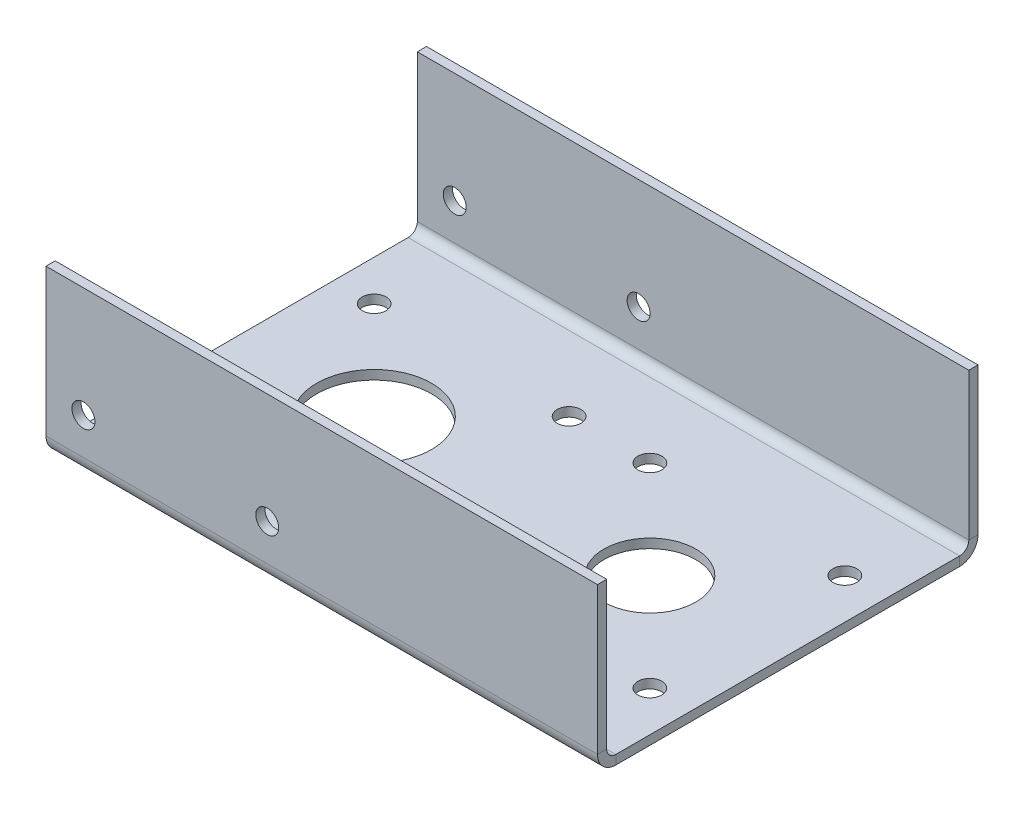
ISO-10303-21;
HEADER;
FILE_DESCRIPTION(('STEP AP214'),'2;1');
FILE_NAME('part.step','',(''),(''),'','','');
FILE_SCHEMA(('AUTOMOTIVE_DESIGN { 1 0 10303 214 1 1 1 1 }'));
ENDSEC;
DATA;
#1=APPLICATION_CONTEXT('core data for automotive mechanical design processes');
#2=APPLICATION_PROTOCOL_DEFINITION('international standard','automotive_design',2000,#1);
#3=PRODUCT_CONTEXT('',#1,'mechanical');
#4=PRODUCT('Part','Part','',(#3));
#5=PRODUCT_RELATED_PRODUCT_CATEGORY('part','',(#4));
#6=PRODUCT_DEFINITION_FORMATION('','',#4);
#7=PRODUCT_DEFINITION_CONTEXT('part definition',#1,'design');
#8=PRODUCT_DEFINITION('design','',#6,#7);
#9=PRODUCT_DEFINITION_SHAPE('','',#8);
#10=(LENGTH_UNIT() NAMED_UNIT(*) SI_UNIT(.MILLI.,.METRE.));
#11=(NAMED_UNIT(*) PLANE_ANGLE_UNIT() SI_UNIT($,.RADIAN.));
#12=(NAMED_UNIT(*) SI_UNIT($,.STERADIAN.) SOLID_ANGLE_UNIT());
#13=UNCERTAINTY_MEASURE_WITH_UNIT(LENGTH_MEASURE(1.E-05),#10,'distance_accuracy_value','');
#14=(GEOMETRIC_REPRESENTATION_CONTEXT(3) GLOBAL_UNCERTAINTY_ASSIGNED_CONTEXT((#13)) GLOBAL_UNIT_ASSIGNED_CONTEXT((#10,
#11,#12)) REPRESENTATION_CONTEXT('',''));
#15=CARTESIAN_POINT('',(0.,0.,0.));
#16=DIRECTION('',(0.,0.,1.));
#17=DIRECTION('',(1.,0.,0.));
#18=AXIS2_PLACEMENT_3D('',#15,#16,#17);
#19=CARTESIAN_POINT('',(0.,-1.27,0.));
#20=DIRECTION('',(0.,1.,0.));
#21=DIRECTION('',(0.,0.,1.));
#22=AXIS2_PLACEMENT_3D('',#19,#20,#21);
#23=PLANE('',#22);
#24=CARTESIAN_POINT('',(5.57961581839621,-1.27,13.4703841816037));
#25=DIRECTION('',(0.,1.,0.));
#26=DIRECTION('',(0.,0.,1.));
#27=AXIS2_PLACEMENT_3D('',#24,#25,#26);
#28=CIRCLE('',#27,1.651);
#29=CARTESIAN_POINT('',(5.57961581839621,-1.27,15.1213841816037));
#30=VERTEX_POINT('',#29);
#31=EDGE_CURVE('E297',#30,#30,#28,.T.);
#32=ORIENTED_EDGE('',*,*,#31,.T.);
#33=EDGE_LOOP('',(#32));
#34=FACE_BOUND('',#33,.T.);
#35=CARTESIAN_POINT('',(32.5203841816037,-1.27,-13.4703841816038));
#36=DIRECTION('',(0.,1.,0.));
#37=DIRECTION('',(0.,0.,1.));
#38=AXIS2_PLACEMENT_3D('',#35,#36,#37);
#39=CIRCLE('',#38,1.651);
#40=CARTESIAN_POINT('',(32.5203841816037,-1.27,-11.8193841816038));
#41=VERTEX_POINT('',#40);
#42=EDGE_CURVE('E294',#41,#41,#39,.T.);
#43=ORIENTED_EDGE('',*,*,#42,.T.);
#44=EDGE_LOOP('',(#43));
#45=FACE_BOUND('',#44,.T.);
#46=CARTESIAN_POINT('',(32.5203841816038,-1.27,13.4703841816037));
#47=DIRECTION('',(0.,1.,0.));
#48=DIRECTION('',(0.,0.,1.));
#49=AXIS2_PLACEMENT_3D('',#46,#47,#48);
#50=CIRCLE('',#49,1.651);
#51=CARTESIAN_POINT('',(32.5203841816038,-1.27,15.1213841816037));
#52=VERTEX_POINT('',#51);
#53=EDGE_CURVE('E289',#52,#52,#50,.T.);
#54=ORIENTED_EDGE('',*,*,#53,.T.);
#55=EDGE_LOOP('',(#54));
#56=FACE_BOUND('',#55,.T.);
#57=CARTESIAN_POINT('',(19.05,-1.27,0.));
#58=DIRECTION('',(0.,1.,0.));
#59=DIRECTION('',(0.,0.,1.));
#60=AXIS2_PLACEMENT_3D('',#57,#58,#59);
#61=CIRCLE('',#60,6.35);
#62=CARTESIAN_POINT('',(19.05,-1.27,6.35));
#63=VERTEX_POINT('',#62);
#64=EDGE_CURVE('E309',#63,#63,#61,.T.);
#65=ORIENTED_EDGE('',*,*,#64,.T.);
#66=EDGE_LOOP('',(#65));
#67=FACE_BOUND('',#66,.T.);
#68=CARTESIAN_POINT('',(5.5796158183962,-1.27,-13.4703841816037));
#69=DIRECTION('',(0.,1.,0.));
#70=DIRECTION('',(0.,0.,1.));
#71=AXIS2_PLACEMENT_3D('',#68,#69,#70);
#72=CIRCLE('',#71,1.651);
#73=CARTESIAN_POINT('',(5.5796158183962,-1.27,-11.8193841816037));
#74=VERTEX_POINT('',#73);
#75=EDGE_CURVE('E304',#74,#74,#72,.T.);
#76=ORIENTED_EDGE('',*,*,#75,.T.);
#77=EDGE_LOOP('',(#76));
#78=FACE_BOUND('',#77,.T.);
#79=CARTESIAN_POINT('',(-32.5203841816037,-1.27000000000001,13.4703841816038));
#80=DIRECTION('',(0.,1.,0.));
#81=DIRECTION('',(1.,0.,0.));
#82=AXIS2_PLACEMENT_3D('',#79,#80,#81);
#83=CIRCLE('',#82,1.65099999999999);
#84=CARTESIAN_POINT('',(-30.8693841816037,-1.27000000000001,13.4703841816038));
#85=VERTEX_POINT('',#84);
#86=EDGE_CURVE('E313',#85,#85,#83,.T.);
#87=ORIENTED_EDGE('',*,*,#86,.T.);
#88=EDGE_LOOP('',(#87));
#89=FACE_BOUND('',#88,.T.);
#90=CARTESIAN_POINT('',(-5.57961581839629,-1.27000000000001,13.4703841816038));
#91=DIRECTION('',(0.,1.,0.));
#92=DIRECTION('',(0.,0.,-1.));
#93=AXIS2_PLACEMENT_3D('',#90,#91,#92);
#94=CIRCLE('',#93,1.65099999999999);
#95=CARTESIAN_POINT('',(-5.57961581839629,-1.27000000000001,11.8193841816038));
#96=VERTEX_POINT('',#95);
#97=EDGE_CURVE('E320',#96,#96,#94,.T.);
#98=ORIENTED_EDGE('',*,*,#97,.T.);
#99=EDGE_LOOP('',(#98));
#100=FACE_BOUND('',#99,.T.);
#101=CARTESIAN_POINT('',(-5.57961581839639,-1.27000000000001,-13.4703841816038));
#102=DIRECTION('',(0.,1.,0.));
#103=DIRECTION('',(-1.,0.,0.));
#104=AXIS2_PLACEMENT_3D('',#101,#102,#103);
#105=CIRCLE('',#104,1.65099999999999);
#106=CARTESIAN_POINT('',(-7.23061581839638,-1.27000000000001,-13.4703841816038));
#107=VERTEX_POINT('',#106);
#108=EDGE_CURVE('E326',#107,#107,#105,.T.);
#109=ORIENTED_EDGE('',*,*,#108,.T.);
#110=EDGE_LOOP('',(#109));
#111=FACE_BOUND('',#110,.T.);
#112=CARTESIAN_POINT('',(-32.5203841816037,-1.27000000000001,-13.4703841816037));
#113=DIRECTION('',(0.,1.,0.));
#114=DIRECTION('',(0.,0.,1.));
#115=AXIS2_PLACEMENT_3D('',#112,#113,#114);
#116=CIRCLE('',#115,1.65099999999999);
#117=CARTESIAN_POINT('',(-32.5203841816037,-1.27000000000001,-11.8193841816038));
#118=VERTEX_POINT('',#117);
#119=EDGE_CURVE('E331',#118,#118,#116,.T.);
#120=ORIENTED_EDGE('',*,*,#119,.T.);
#121=EDGE_LOOP('',(#120));
#122=FACE_BOUND('',#121,.T.);
#123=CARTESIAN_POINT('',(-19.05,-1.27,0.));
#124=DIRECTION('',(0.,1.,0.));
#125=DIRECTION('',(0.,0.,1.));
#126=AXIS2_PLACEMENT_3D('',#123,#124,#125);
#127=CIRCLE('',#126,7.9375);
#128=CARTESIAN_POINT('',(-19.05,-1.27,7.93750000000001));
#129=VERTEX_POINT('',#128);
#130=EDGE_CURVE('E247',#129,#129,#127,.T.);
#131=ORIENTED_EDGE('',*,*,#130,.T.);
#132=EDGE_LOOP('',(#131));
#133=FACE_BOUND('',#132,.T.);
#134=DIRECTION('',(-1.,0.,0.));
#135=VECTOR('',#134,1.);
#136=CARTESIAN_POINT('',(-38.1,-1.27000000000001,-23.749));
#137=LINE('',#136,#135);
#138=CARTESIAN_POINT('',(-38.1,-1.27000000000001,-23.749));
#139=VERTEX_POINT('',#138);
#140=CARTESIAN_POINT('',(38.1,-1.27,-23.749));
#141=VERTEX_POINT('',#140);
#142=EDGE_CURVE('E136',#139,#141,#137,.F.);
#143=ORIENTED_EDGE('',*,*,#142,.T.);
#144=DIRECTION('',(0.,0.,-1.));
#145=VECTOR('',#144,1.);
#146=CARTESIAN_POINT('',(38.1,-1.27,-25.019));
#147=LINE('',#146,#145);
#148=CARTESIAN_POINT('',(38.1,-1.27,23.749));
#149=VERTEX_POINT('',#148);
#150=EDGE_CURVE('E47',#149,#141,#147,.T.);
#151=ORIENTED_EDGE('',*,*,#150,.F.);
#152=DIRECTION('',(1.,0.,0.));
#153=VECTOR('',#152,1.);
#154=CARTESIAN_POINT('',(38.1,-1.27,23.749));
#155=LINE('',#154,#153);
#156=CARTESIAN_POINT('',(-38.1,-1.27,23.749));
#157=VERTEX_POINT('',#156);
#158=EDGE_CURVE('E226',#149,#157,#155,.F.);
#159=ORIENTED_EDGE('',*,*,#158,.T.);
#160=DIRECTION('',(0.,0.,1.));
#161=VECTOR('',#160,1.);
#162=CARTESIAN_POINT('',(-38.1,-1.27,-25.019));
#163=LINE('',#162,#161);
#164=EDGE_CURVE('E11',#139,#157,#163,.T.);
#165=ORIENTED_EDGE('',*,*,#164,.F.);
#166=EDGE_LOOP('',(#143,#151,#159,#165));
#167=FACE_BOUND('',#166,.T.);
#168=ADVANCED_FACE('F38',(#34,#45,#56,#67,#78,#89,#100,#111,#122,#133,#167),#23,.F.);
#169=CARTESIAN_POINT('',(0.,0.,0.));
#170=DIRECTION('',(0.,1.,0.));
#171=DIRECTION('',(0.,0.,1.));
#172=AXIS2_PLACEMENT_3D('',#169,#170,#171);
#173=PLANE('',#172);
#174=CARTESIAN_POINT('',(5.57961581839621,0.,13.4703841816037));
#175=DIRECTION('',(0.,1.,0.));
#176=DIRECTION('',(1.,0.,0.));
#177=AXIS2_PLACEMENT_3D('',#174,#175,#176);
#178=CIRCLE('',#177,1.651);
#179=CARTESIAN_POINT('',(7.23061581839621,0.,13.4703841816037));
#180=VERTEX_POINT('',#179);
#181=EDGE_CURVE('E282',#180,#180,#178,.T.);
#182=ORIENTED_EDGE('',*,*,#181,.F.);
#183=EDGE_LOOP('',(#182));
#184=FACE_BOUND('',#183,.T.);
#185=CARTESIAN_POINT('',(32.5203841816037,0.,-13.4703841816038));
#186=DIRECTION('',(0.,1.,0.));
#187=DIRECTION('',(-1.,0.,0.));
#188=AXIS2_PLACEMENT_3D('',#185,#186,#187);
#189=CIRCLE('',#188,1.651);
#190=CARTESIAN_POINT('',(30.8693841816037,0.,-13.4703841816038));
#191=VERTEX_POINT('',#190);
#192=EDGE_CURVE('E286',#191,#191,#189,.T.);
#193=ORIENTED_EDGE('',*,*,#192,.F.);
#194=EDGE_LOOP('',(#193));
#195=FACE_BOUND('',#194,.T.);
#196=CARTESIAN_POINT('',(32.5203841816038,0.,13.4703841816037));
#197=DIRECTION('',(0.,1.,0.));
#198=DIRECTION('',(0.,0.,-1.));
#199=AXIS2_PLACEMENT_3D('',#196,#197,#198);
#200=CIRCLE('',#199,1.651);
#201=CARTESIAN_POINT('',(32.5203841816038,0.,11.8193841816037));
#202=VERTEX_POINT('',#201);
#203=EDGE_CURVE('E283',#202,#202,#200,.T.);
#204=ORIENTED_EDGE('',*,*,#203,.F.);
#205=EDGE_LOOP('',(#204));
#206=FACE_BOUND('',#205,.T.);
#207=CARTESIAN_POINT('',(19.05,0.,0.));
#208=DIRECTION('',(0.,1.,0.));
#209=DIRECTION('',(0.,0.,1.));
#210=AXIS2_PLACEMENT_3D('',#207,#208,#209);
#211=CIRCLE('',#210,6.35);
#212=CARTESIAN_POINT('',(19.05,0.,6.35));
#213=VERTEX_POINT('',#212);
#214=EDGE_CURVE('E301',#213,#213,#211,.T.);
#215=ORIENTED_EDGE('',*,*,#214,.F.);
#216=EDGE_LOOP('',(#215));
#217=FACE_BOUND('',#216,.T.);
#218=CARTESIAN_POINT('',(5.5796158183962,0.,-13.4703841816037));
#219=DIRECTION('',(0.,1.,0.));
#220=DIRECTION('',(0.,0.,1.));
#221=AXIS2_PLACEMENT_3D('',#218,#219,#220);
#222=CIRCLE('',#221,1.651);
#223=CARTESIAN_POINT('',(5.5796158183962,0.,-11.8193841816037));
#224=VERTEX_POINT('',#223);
#225=EDGE_CURVE('E300',#224,#224,#222,.T.);
#226=ORIENTED_EDGE('',*,*,#225,.F.);
#227=EDGE_LOOP('',(#226));
#228=FACE_BOUND('',#227,.T.);
#229=CARTESIAN_POINT('',(-32.5203841816037,0.,13.4703841816038));
#230=DIRECTION('',(0.,1.,0.));
#231=DIRECTION('',(1.,0.,0.));
#232=AXIS2_PLACEMENT_3D('',#229,#230,#231);
#233=CIRCLE('',#232,1.65099999999999);
#234=CARTESIAN_POINT('',(-30.8693841816037,0.,13.4703841816038));
#235=VERTEX_POINT('',#234);
#236=EDGE_CURVE('E317',#235,#235,#233,.T.);
#237=ORIENTED_EDGE('',*,*,#236,.F.);
#238=EDGE_LOOP('',(#237));
#239=FACE_BOUND('',#238,.T.);
#240=CARTESIAN_POINT('',(-5.57961581839629,0.,13.4703841816038));
#241=DIRECTION('',(0.,1.,0.));
#242=DIRECTION('',(0.,0.,-1.));
#243=AXIS2_PLACEMENT_3D('',#240,#241,#242);
#244=CIRCLE('',#243,1.65099999999999);
#245=CARTESIAN_POINT('',(-5.57961581839629,0.,11.8193841816038));
#246=VERTEX_POINT('',#245);
#247=EDGE_CURVE('E323',#246,#246,#244,.T.);
#248=ORIENTED_EDGE('',*,*,#247,.F.);
#249=EDGE_LOOP('',(#248));
#250=FACE_BOUND('',#249,.T.);
#251=CARTESIAN_POINT('',(-5.57961581839639,0.,-13.4703841816038));
#252=DIRECTION('',(0.,1.,0.));
#253=DIRECTION('',(-1.,0.,0.));
#254=AXIS2_PLACEMENT_3D('',#251,#252,#253);
#255=CIRCLE('',#254,1.65099999999999);
#256=CARTESIAN_POINT('',(-7.23061581839638,0.,-13.4703841816038));
#257=VERTEX_POINT('',#256);
#258=EDGE_CURVE('E312',#257,#257,#255,.T.);
#259=ORIENTED_EDGE('',*,*,#258,.F.);
#260=EDGE_LOOP('',(#259));
#261=FACE_BOUND('',#260,.T.);
#262=CARTESIAN_POINT('',(-32.5203841816037,0.,-13.4703841816037));
#263=DIRECTION('',(0.,1.,0.));
#264=DIRECTION('',(0.,0.,1.));
#265=AXIS2_PLACEMENT_3D('',#262,#263,#264);
#266=CIRCLE('',#265,1.65099999999999);
#267=CARTESIAN_POINT('',(-32.5203841816037,0.,-11.8193841816038));
#268=VERTEX_POINT('',#267);
#269=EDGE_CURVE('E316',#268,#268,#266,.T.);
#270=ORIENTED_EDGE('',*,*,#269,.F.);
#271=EDGE_LOOP('',(#270));
#272=FACE_BOUND('',#271,.T.);
#273=CARTESIAN_POINT('',(-19.05,0.,0.));
#274=DIRECTION('',(0.,1.,0.));
#275=DIRECTION('',(0.,0.,1.));
#276=AXIS2_PLACEMENT_3D('',#273,#274,#275);
#277=CIRCLE('',#276,7.9375);
#278=CARTESIAN_POINT('',(-19.05,0.,7.93750000000001));
#279=VERTEX_POINT('',#278);
#280=EDGE_CURVE('E244',#279,#279,#277,.T.);
#281=ORIENTED_EDGE('',*,*,#280,.F.);
#282=EDGE_LOOP('',(#281));
#283=FACE_BOUND('',#282,.T.);
#284=DIRECTION('',(0.,0.,-1.));
#285=VECTOR('',#284,1.);
#286=CARTESIAN_POINT('',(38.1,0.,-25.019));
#287=LINE('',#286,#285);
#288=CARTESIAN_POINT('',(38.1,0.,23.749));
#289=VERTEX_POINT('',#288);
#290=CARTESIAN_POINT('',(38.1,0.,-23.749));
#291=VERTEX_POINT('',#290);
#292=EDGE_CURVE('E250',#289,#291,#287,.T.);
#293=ORIENTED_EDGE('',*,*,#292,.T.);
#294=DIRECTION('',(-1.,0.,0.));
#295=VECTOR('',#294,1.);
#296=CARTESIAN_POINT('',(-38.1,0.,-23.749));
#297=LINE('',#296,#295);
#298=CARTESIAN_POINT('',(-38.1,0.,-23.749));
#299=VERTEX_POINT('',#298);
#300=EDGE_CURVE('E187',#299,#291,#297,.F.);
#301=ORIENTED_EDGE('',*,*,#300,.F.);
#302=DIRECTION('',(0.,0.,1.));
#303=VECTOR('',#302,1.);
#304=CARTESIAN_POINT('',(-38.1,0.,-25.019));
#305=LINE('',#304,#303);
#306=CARTESIAN_POINT('',(-38.1,0.,23.749));
#307=VERTEX_POINT('',#306);
#308=EDGE_CURVE('E254',#299,#307,#305,.T.);
#309=ORIENTED_EDGE('',*,*,#308,.T.);
#310=DIRECTION('',(1.,0.,0.));
#311=VECTOR('',#310,1.);
#312=CARTESIAN_POINT('',(38.1,0.,23.749));
#313=LINE('',#312,#311);
#314=EDGE_CURVE('E55',#289,#307,#313,.F.);
#315=ORIENTED_EDGE('',*,*,#314,.F.);
#316=EDGE_LOOP('',(#293,#301,#309,#315));
#317=FACE_BOUND('',#316,.T.);
#318=ADVANCED_FACE('F368',(#184,#195,#206,#217,#228,#239,#250,#261,#272,#283,#317),#173,.T.);
#319=CARTESIAN_POINT('',(-38.1,-1.27,-25.019));
#320=DIRECTION('',(-1.,0.,0.));
#321=DIRECTION('',(0.,0.,1.));
#322=AXIS2_PLACEMENT_3D('',#319,#320,#321);
#323=PLANE('',#322);
#324=ORIENTED_EDGE('',*,*,#308,.F.);
#325=DIRECTION('',(0.,-1.,0.));
#326=VECTOR('',#325,1.);
#327=CARTESIAN_POINT('',(-38.1,0.,-23.749));
#328=LINE('',#327,#326);
#329=EDGE_CURVE('E183',#299,#139,#328,.T.);
#330=ORIENTED_EDGE('',*,*,#329,.T.);
#331=ORIENTED_EDGE('',*,*,#164,.T.);
#332=DIRECTION('',(0.,-1.,0.));
#333=VECTOR('',#332,1.);
#334=CARTESIAN_POINT('',(-38.1,0.,23.749));
#335=LINE('',#334,#333);
#336=EDGE_CURVE('E241',#307,#157,#335,.T.);
#337=ORIENTED_EDGE('',*,*,#336,.F.);
#338=EDGE_LOOP('',(#324,#330,#331,#337));
#339=FACE_BOUND('',#338,.T.);
#340=ADVANCED_FACE('F374',(#339),#323,.T.);
#341=CARTESIAN_POINT('',(38.1,-1.27,-25.019));
#342=DIRECTION('',(1.,0.,0.));
#343=DIRECTION('',(0.,0.,-1.));
#344=AXIS2_PLACEMENT_3D('',#341,#342,#343);
#345=PLANE('',#344);
#346=DIRECTION('',(0.,-1.,0.));
#347=VECTOR('',#346,1.);
#348=CARTESIAN_POINT('',(38.1,0.,-23.749));
#349=LINE('',#348,#347);
#350=EDGE_CURVE('E191',#291,#141,#349,.T.);
#351=ORIENTED_EDGE('',*,*,#350,.F.);
#352=ORIENTED_EDGE('',*,*,#292,.F.);
#353=DIRECTION('',(0.,-1.,0.));
#354=VECTOR('',#353,1.);
#355=CARTESIAN_POINT('',(38.1,0.,23.749));
#356=LINE('',#355,#354);
#357=EDGE_CURVE('E232',#289,#149,#356,.T.);
#358=ORIENTED_EDGE('',*,*,#357,.T.);
#359=ORIENTED_EDGE('',*,*,#150,.T.);
#360=EDGE_LOOP('',(#351,#352,#358,#359));
#361=FACE_BOUND('',#360,.T.);
#362=ADVANCED_FACE('F40',(#361),#345,.T.);
#363=CARTESIAN_POINT('',(-19.05,-1.27,0.));
#364=DIRECTION('',(0.,1.,0.));
#365=DIRECTION('',(0.,0.,1.));
#366=AXIS2_PLACEMENT_3D('',#363,#364,#365);
#367=CYLINDRICAL_SURFACE('',#366,7.9375);
#368=ORIENTED_EDGE('',*,*,#130,.F.);
#369=EDGE_LOOP('',(#368));
#370=FACE_BOUND('',#369,.T.);
#371=ORIENTED_EDGE('',*,*,#280,.T.);
#372=EDGE_LOOP('',(#371));
#373=FACE_BOUND('',#372,.T.);
#374=ADVANCED_FACE('F379',(#370,#373),#367,.F.);
#375=CARTESIAN_POINT('',(-38.1,1.27,23.749));
#376=DIRECTION('',(-1.,0.,0.));
#377=DIRECTION('',(0.,0.,1.));
#378=AXIS2_PLACEMENT_3D('',#375,#376,#377);
#379=PLANE('',#378);
#380=DIRECTION('',(0.,0.,1.));
#381=VECTOR('',#380,1.);
#382=CARTESIAN_POINT('',(-38.1,1.27,25.019));
#383=LINE('',#382,#381);
#384=CARTESIAN_POINT('',(-38.1,1.27,25.019));
#385=VERTEX_POINT('',#384);
#386=CARTESIAN_POINT('',(-38.1,1.27,26.289));
#387=VERTEX_POINT('',#386);
#388=EDGE_CURVE('E194',#385,#387,#383,.T.);
#389=ORIENTED_EDGE('',*,*,#388,.F.);
#390=CARTESIAN_POINT('',(-38.1,1.27,23.749));
#391=DIRECTION('',(1.,0.,0.));
#392=DIRECTION('',(0.,0.,-1.));
#393=AXIS2_PLACEMENT_3D('',#390,#391,#392);
#394=CIRCLE('',#393,1.27);
#395=EDGE_CURVE('E235',#307,#385,#394,.F.);
#396=ORIENTED_EDGE('',*,*,#395,.F.);
#397=ORIENTED_EDGE('',*,*,#336,.T.);
#398=CARTESIAN_POINT('',(-38.1,1.27,23.749));
#399=DIRECTION('',(1.,0.,0.));
#400=DIRECTION('',(0.,0.,-1.));
#401=AXIS2_PLACEMENT_3D('',#398,#399,#400);
#402=CIRCLE('',#401,2.54);
#403=EDGE_CURVE('E228',#157,#387,#402,.F.);
#404=ORIENTED_EDGE('',*,*,#403,.T.);
#405=EDGE_LOOP('',(#389,#396,#397,#404));
#406=FACE_BOUND('',#405,.T.);
#407=ADVANCED_FACE('F420',(#406),#379,.T.);
#408=CARTESIAN_POINT('',(38.1,1.27,23.749));
#409=DIRECTION('',(-1.,0.,0.));
#410=DIRECTION('',(0.,0.,1.));
#411=AXIS2_PLACEMENT_3D('',#408,#409,#410);
#412=PLANE('',#411);
#413=CARTESIAN_POINT('',(38.1,1.27,23.749));
#414=DIRECTION('',(1.,0.,0.));
#415=DIRECTION('',(0.,0.,-1.));
#416=AXIS2_PLACEMENT_3D('',#413,#414,#415);
#417=CIRCLE('',#416,1.27);
#418=CARTESIAN_POINT('',(38.1,1.27,25.019));
#419=VERTEX_POINT('',#418);
#420=EDGE_CURVE('E225',#419,#289,#417,.T.);
#421=ORIENTED_EDGE('',*,*,#420,.F.);
#422=DIRECTION('',(0.,0.,1.));
#423=VECTOR('',#422,1.);
#424=CARTESIAN_POINT('',(38.1,1.27,25.019));
#425=LINE('',#424,#423);
#426=CARTESIAN_POINT('',(38.1,1.27,26.289));
#427=VERTEX_POINT('',#426);
#428=EDGE_CURVE('E198',#419,#427,#425,.T.);
#429=ORIENTED_EDGE('',*,*,#428,.T.);
#430=CARTESIAN_POINT('',(38.1,1.27,23.749));
#431=DIRECTION('',(1.,0.,0.));
#432=DIRECTION('',(0.,0.,-1.));
#433=AXIS2_PLACEMENT_3D('',#430,#431,#432);
#434=CIRCLE('',#433,2.54);
#435=EDGE_CURVE('E229',#427,#149,#434,.T.);
#436=ORIENTED_EDGE('',*,*,#435,.T.);
#437=ORIENTED_EDGE('',*,*,#357,.F.);
#438=EDGE_LOOP('',(#421,#429,#436,#437));
#439=FACE_BOUND('',#438,.T.);
#440=ADVANCED_FACE('F391',(#439),#412,.F.);
#441=CARTESIAN_POINT('',(38.1,1.27,23.749));
#442=DIRECTION('',(1.,0.,0.));
#443=DIRECTION('',(0.,0.,1.));
#444=AXIS2_PLACEMENT_3D('',#441,#442,#443);
#445=CYLINDRICAL_SURFACE('',#444,2.54);
#446=ORIENTED_EDGE('',*,*,#158,.F.);
#447=ORIENTED_EDGE('',*,*,#435,.F.);
#448=DIRECTION('',(-1.,0.,0.));
#449=VECTOR('',#448,1.);
#450=CARTESIAN_POINT('',(0.,1.27,26.289));
#451=LINE('',#450,#449);
#452=EDGE_CURVE('E201',#427,#387,#451,.T.);
#453=ORIENTED_EDGE('',*,*,#452,.T.);
#454=ORIENTED_EDGE('',*,*,#403,.F.);
#455=EDGE_LOOP('',(#446,#447,#453,#454));
#456=FACE_BOUND('',#455,.T.);
#457=ADVANCED_FACE('F418',(#456),#445,.T.);
#458=CARTESIAN_POINT('',(38.1,1.27,23.749));
#459=DIRECTION('',(1.,0.,0.));
#460=DIRECTION('',(0.,0.,1.));
#461=AXIS2_PLACEMENT_3D('',#458,#459,#460);
#462=CYLINDRICAL_SURFACE('',#461,1.27);
#463=ORIENTED_EDGE('',*,*,#314,.T.);
#464=ORIENTED_EDGE('',*,*,#395,.T.);
#465=DIRECTION('',(1.,0.,0.));
#466=VECTOR('',#465,1.);
#467=CARTESIAN_POINT('',(-38.1,1.27,25.019));
#468=LINE('',#467,#466);
#469=EDGE_CURVE('E196',#385,#419,#468,.T.);
#470=ORIENTED_EDGE('',*,*,#469,.T.);
#471=ORIENTED_EDGE('',*,*,#420,.T.);
#472=EDGE_LOOP('',(#463,#464,#470,#471));
#473=FACE_BOUND('',#472,.T.);
#474=ADVANCED_FACE('F394',(#473),#462,.F.);
#475=CARTESIAN_POINT('',(-38.1,0.,26.289));
#476=DIRECTION('',(1.,0.,0.));
#477=DIRECTION('',(0.,0.,-1.));
#478=AXIS2_PLACEMENT_3D('',#475,#476,#477);
#479=PLANE('',#478);
#480=ORIENTED_EDGE('',*,*,#388,.T.);
#481=DIRECTION('',(0.,-1.,0.));
#482=VECTOR('',#481,1.);
#483=CARTESIAN_POINT('',(-38.1,0.,26.289));
#484=LINE('',#483,#482);
#485=CARTESIAN_POINT('',(-38.1,21.59,26.289));
#486=VERTEX_POINT('',#485);
#487=EDGE_CURVE('E206',#486,#387,#484,.T.);
#488=ORIENTED_EDGE('',*,*,#487,.F.);
#489=DIRECTION('',(0.,0.,-1.));
#490=VECTOR('',#489,1.);
#491=CARTESIAN_POINT('',(-38.1,21.59,26.289));
#492=LINE('',#491,#490);
#493=CARTESIAN_POINT('',(-38.1,21.59,25.019));
#494=VERTEX_POINT('',#493);
#495=EDGE_CURVE('E214',#486,#494,#492,.T.);
#496=ORIENTED_EDGE('',*,*,#495,.T.);
#497=DIRECTION('',(0.,-1.,0.));
#498=VECTOR('',#497,1.);
#499=CARTESIAN_POINT('',(-38.1,0.,25.019));
#500=LINE('',#499,#498);
#501=EDGE_CURVE('E205',#494,#385,#500,.T.);
#502=ORIENTED_EDGE('',*,*,#501,.T.);
#503=EDGE_LOOP('',(#480,#488,#496,#502));
#504=FACE_BOUND('',#503,.T.);
#505=ADVANCED_FACE('F403',(#504),#479,.F.);
#506=CARTESIAN_POINT('',(38.1,21.59,26.289));
#507=DIRECTION('',(-1.,0.,0.));
#508=DIRECTION('',(0.,0.,1.));
#509=AXIS2_PLACEMENT_3D('',#506,#507,#508);
#510=PLANE('',#509);
#511=ORIENTED_EDGE('',*,*,#428,.F.);
#512=DIRECTION('',(0.,1.,0.));
#513=VECTOR('',#512,1.);
#514=CARTESIAN_POINT('',(38.1,21.59,25.019));
#515=LINE('',#514,#513);
#516=CARTESIAN_POINT('',(38.1,21.59,25.019));
#517=VERTEX_POINT('',#516);
#518=EDGE_CURVE('E217',#419,#517,#515,.T.);
#519=ORIENTED_EDGE('',*,*,#518,.T.);
#520=DIRECTION('',(0.,0.,-1.));
#521=VECTOR('',#520,1.);
#522=CARTESIAN_POINT('',(38.1,21.59,26.289));
#523=LINE('',#522,#521);
#524=CARTESIAN_POINT('',(38.1,21.59,26.289));
#525=VERTEX_POINT('',#524);
#526=EDGE_CURVE('E222',#525,#517,#523,.T.);
#527=ORIENTED_EDGE('',*,*,#526,.F.);
#528=DIRECTION('',(0.,1.,0.));
#529=VECTOR('',#528,1.);
#530=CARTESIAN_POINT('',(38.1,21.59,26.289));
#531=LINE('',#530,#529);
#532=EDGE_CURVE('E209',#427,#525,#531,.T.);
#533=ORIENTED_EDGE('',*,*,#532,.F.);
#534=EDGE_LOOP('',(#511,#519,#527,#533));
#535=FACE_BOUND('',#534,.T.);
#536=ADVANCED_FACE('F412',(#535),#510,.F.);
#537=CARTESIAN_POINT('',(0.,0.,26.289));
#538=DIRECTION('',(0.,0.,-1.));
#539=DIRECTION('',(-1.,0.,0.));
#540=AXIS2_PLACEMENT_3D('',#537,#538,#539);
#541=PLANE('',#540);
#542=CARTESIAN_POINT('',(-7.52855999999999,6.35000000000001,26.289));
#543=DIRECTION('',(0.,0.,-1.));
#544=DIRECTION('',(-1.,0.,0.));
#545=AXIS2_PLACEMENT_3D('',#542,#543,#544);
#546=CIRCLE('',#545,1.5875);
#547=CARTESIAN_POINT('',(-9.11605999999999,6.35000000000001,26.289));
#548=VERTEX_POINT('',#547);
#549=EDGE_CURVE('E260',#548,#548,#546,.T.);
#550=ORIENTED_EDGE('',*,*,#549,.T.);
#551=EDGE_LOOP('',(#550));
#552=FACE_BOUND('',#551,.T.);
#553=CARTESIAN_POINT('',(-32.92856,6.35000000000001,26.289));
#554=DIRECTION('',(0.,0.,-1.));
#555=DIRECTION('',(1.,0.,0.));
#556=AXIS2_PLACEMENT_3D('',#553,#554,#555);
#557=CIRCLE('',#556,1.5875);
#558=CARTESIAN_POINT('',(-31.34106,6.35000000000001,26.289));
#559=VERTEX_POINT('',#558);
#560=EDGE_CURVE('E267',#559,#559,#557,.T.);
#561=ORIENTED_EDGE('',*,*,#560,.T.);
#562=EDGE_LOOP('',(#561));
#563=FACE_BOUND('',#562,.T.);
#564=ORIENTED_EDGE('',*,*,#452,.F.);
#565=ORIENTED_EDGE('',*,*,#532,.T.);
#566=DIRECTION('',(-1.,0.,0.));
#567=VECTOR('',#566,1.);
#568=CARTESIAN_POINT('',(-38.1,21.59,26.289));
#569=LINE('',#568,#567);
#570=EDGE_CURVE('E212',#525,#486,#569,.T.);
#571=ORIENTED_EDGE('',*,*,#570,.T.);
#572=ORIENTED_EDGE('',*,*,#487,.T.);
#573=EDGE_LOOP('',(#564,#565,#571,#572));
#574=FACE_BOUND('',#573,.T.);
#575=ADVANCED_FACE('F415',(#552,#563,#574),#541,.F.);
#576=CARTESIAN_POINT('',(0.,0.,25.019));
#577=DIRECTION('',(0.,0.,-1.));
#578=DIRECTION('',(-1.,0.,0.));
#579=AXIS2_PLACEMENT_3D('',#576,#577,#578);
#580=PLANE('',#579);
#581=CARTESIAN_POINT('',(-7.52855999999999,6.35000000000001,25.019));
#582=DIRECTION('',(0.,0.,-1.));
#583=DIRECTION('',(-1.,0.,0.));
#584=AXIS2_PLACEMENT_3D('',#581,#582,#583);
#585=CIRCLE('',#584,1.5875);
#586=CARTESIAN_POINT('',(-9.11605999999999,6.35000000000001,25.019));
#587=VERTEX_POINT('',#586);
#588=EDGE_CURVE('E279',#587,#587,#585,.T.);
#589=ORIENTED_EDGE('',*,*,#588,.F.);
#590=EDGE_LOOP('',(#589));
#591=FACE_BOUND('',#590,.T.);
#592=CARTESIAN_POINT('',(-32.92856,6.35000000000001,25.019));
#593=DIRECTION('',(0.,0.,-1.));
#594=DIRECTION('',(-1.,0.,0.));
#595=AXIS2_PLACEMENT_3D('',#592,#593,#594);
#596=CIRCLE('',#595,1.5875);
#597=CARTESIAN_POINT('',(-34.51606,6.35000000000001,25.019));
#598=VERTEX_POINT('',#597);
#599=EDGE_CURVE('E264',#598,#598,#596,.T.);
#600=ORIENTED_EDGE('',*,*,#599,.F.);
#601=EDGE_LOOP('',(#600));
#602=FACE_BOUND('',#601,.T.);
#603=ORIENTED_EDGE('',*,*,#518,.F.);
#604=ORIENTED_EDGE('',*,*,#469,.F.);
#605=ORIENTED_EDGE('',*,*,#501,.F.);
#606=DIRECTION('',(-1.,0.,0.));
#607=VECTOR('',#606,1.);
#608=CARTESIAN_POINT('',(-38.1,21.59,25.019));
#609=LINE('',#608,#607);
#610=EDGE_CURVE('E210',#517,#494,#609,.T.);
#611=ORIENTED_EDGE('',*,*,#610,.F.);
#612=EDGE_LOOP('',(#603,#604,#605,#611));
#613=FACE_BOUND('',#612,.T.);
#614=ADVANCED_FACE('F400',(#591,#602,#613),#580,.T.);
#615=CARTESIAN_POINT('',(-38.1,21.59,26.289));
#616=DIRECTION('',(0.,-1.,0.));
#617=DIRECTION('',(0.,0.,-1.));
#618=AXIS2_PLACEMENT_3D('',#615,#616,#617);
#619=PLANE('',#618);
#620=ORIENTED_EDGE('',*,*,#610,.T.);
#621=ORIENTED_EDGE('',*,*,#495,.F.);
#622=ORIENTED_EDGE('',*,*,#570,.F.);
#623=ORIENTED_EDGE('',*,*,#526,.T.);
#624=EDGE_LOOP('',(#620,#621,#622,#623));
#625=FACE_BOUND('',#624,.T.);
#626=ADVANCED_FACE('F408',(#625),#619,.F.);
#627=CARTESIAN_POINT('',(38.1,1.26999999999999,-23.749));
#628=DIRECTION('',(1.,0.,0.));
#629=DIRECTION('',(0.,0.,-1.));
#630=AXIS2_PLACEMENT_3D('',#627,#628,#629);
#631=PLANE('',#630);
#632=DIRECTION('',(0.,0.,-1.));
#633=VECTOR('',#632,1.);
#634=CARTESIAN_POINT('',(38.1,1.27,-25.019));
#635=LINE('',#634,#633);
#636=CARTESIAN_POINT('',(38.1,1.26999999999999,-25.019));
#637=VERTEX_POINT('',#636);
#638=CARTESIAN_POINT('',(38.1,1.26999999999999,-26.289));
#639=VERTEX_POINT('',#638);
#640=EDGE_CURVE('E334',#637,#639,#635,.T.);
#641=ORIENTED_EDGE('',*,*,#640,.F.);
#642=CARTESIAN_POINT('',(38.1,1.26999999999999,-23.749));
#643=DIRECTION('',(-1.,0.,0.));
#644=DIRECTION('',(0.,0.,1.));
#645=AXIS2_PLACEMENT_3D('',#642,#643,#644);
#646=CIRCLE('',#645,1.27);
#647=EDGE_CURVE('E139',#291,#637,#646,.F.);
#648=ORIENTED_EDGE('',*,*,#647,.F.);
#649=ORIENTED_EDGE('',*,*,#350,.T.);
#650=CARTESIAN_POINT('',(38.1,1.26999999999999,-23.749));
#651=DIRECTION('',(-1.,0.,0.));
#652=DIRECTION('',(0.,0.,1.));
#653=AXIS2_PLACEMENT_3D('',#650,#651,#652);
#654=CIRCLE('',#653,2.54);
#655=EDGE_CURVE('E182',#141,#639,#654,.F.);
#656=ORIENTED_EDGE('',*,*,#655,.T.);
#657=EDGE_LOOP('',(#641,#648,#649,#656));
#658=FACE_BOUND('',#657,.T.);
#659=ADVANCED_FACE('F344',(#658),#631,.T.);
#660=CARTESIAN_POINT('',(-38.1,1.26999999999999,-23.749));
#661=DIRECTION('',(1.,0.,0.));
#662=DIRECTION('',(0.,0.,-1.));
#663=AXIS2_PLACEMENT_3D('',#660,#661,#662);
#664=PLANE('',#663);
#665=CARTESIAN_POINT('',(-38.1,1.26999999999999,-23.749));
#666=DIRECTION('',(-1.,0.,0.));
#667=DIRECTION('',(0.,0.,1.));
#668=AXIS2_PLACEMENT_3D('',#665,#666,#667);
#669=CIRCLE('',#668,1.27);
#670=CARTESIAN_POINT('',(-38.1,1.26999999999999,-25.019));
#671=VERTEX_POINT('',#670);
#672=EDGE_CURVE('E146',#671,#299,#669,.T.);
#673=ORIENTED_EDGE('',*,*,#672,.F.);
#674=DIRECTION('',(0.,0.,-1.));
#675=VECTOR('',#674,1.);
#676=CARTESIAN_POINT('',(-38.1,1.27,-25.019));
#677=LINE('',#676,#675);
#678=CARTESIAN_POINT('',(-38.1,1.27000000000001,-26.289));
#679=VERTEX_POINT('',#678);
#680=EDGE_CURVE('E143',#671,#679,#677,.T.);
#681=ORIENTED_EDGE('',*,*,#680,.T.);
#682=CARTESIAN_POINT('',(-38.1,1.26999999999999,-23.749));
#683=DIRECTION('',(-1.,0.,0.));
#684=DIRECTION('',(0.,0.,1.));
#685=AXIS2_PLACEMENT_3D('',#682,#683,#684);
#686=CIRCLE('',#685,2.54);
#687=EDGE_CURVE('E129',#679,#139,#686,.T.);
#688=ORIENTED_EDGE('',*,*,#687,.T.);
#689=ORIENTED_EDGE('',*,*,#329,.F.);
#690=EDGE_LOOP('',(#673,#681,#688,#689));
#691=FACE_BOUND('',#690,.T.);
#692=ADVANCED_FACE('F144',(#691),#664,.F.);
#693=CARTESIAN_POINT('',(-38.1,1.26999999999999,-23.749));
#694=DIRECTION('',(-1.,0.,0.));
#695=DIRECTION('',(0.,0.,-1.));
#696=AXIS2_PLACEMENT_3D('',#693,#694,#695);
#697=CYLINDRICAL_SURFACE('',#696,2.54);
#698=ORIENTED_EDGE('',*,*,#142,.F.);
#699=ORIENTED_EDGE('',*,*,#687,.F.);
#700=DIRECTION('',(1.,0.,0.));
#701=VECTOR('',#700,1.);
#702=CARTESIAN_POINT('',(0.,1.27000000000001,-26.289));
#703=LINE('',#702,#701);
#704=EDGE_CURVE('E134',#679,#639,#703,.T.);
#705=ORIENTED_EDGE('',*,*,#704,.T.);
#706=ORIENTED_EDGE('',*,*,#655,.F.);
#707=EDGE_LOOP('',(#698,#699,#705,#706));
#708=FACE_BOUND('',#707,.T.);
#709=ADVANCED_FACE('F131',(#708),#697,.T.);
#710=CARTESIAN_POINT('',(-38.1,1.26999999999999,-23.749));
#711=DIRECTION('',(-1.,0.,0.));
#712=DIRECTION('',(0.,0.,-1.));
#713=AXIS2_PLACEMENT_3D('',#710,#711,#712);
#714=CYLINDRICAL_SURFACE('',#713,1.27);
#715=ORIENTED_EDGE('',*,*,#300,.T.);
#716=ORIENTED_EDGE('',*,*,#647,.T.);
#717=DIRECTION('',(-1.,0.,0.));
#718=VECTOR('',#717,1.);
#719=CARTESIAN_POINT('',(38.1,1.27,-25.019));
#720=LINE('',#719,#718);
#721=EDGE_CURVE('E151',#637,#671,#720,.T.);
#722=ORIENTED_EDGE('',*,*,#721,.T.);
#723=ORIENTED_EDGE('',*,*,#672,.T.);
#724=EDGE_LOOP('',(#715,#716,#722,#723));
#725=FACE_BOUND('',#724,.T.);
#726=ADVANCED_FACE('F347',(#725),#714,.F.);
#727=CARTESIAN_POINT('',(-38.1,0.,-26.289));
#728=DIRECTION('',(-1.,0.,0.));
#729=DIRECTION('',(0.,0.,1.));
#730=AXIS2_PLACEMENT_3D('',#727,#728,#729);
#731=PLANE('',#730);
#732=DIRECTION('',(0.,-1.,0.));
#733=VECTOR('',#732,1.);
#734=CARTESIAN_POINT('',(-38.1,0.,-26.289));
#735=LINE('',#734,#733);
#736=CARTESIAN_POINT('',(-38.1,21.59,-26.289));
#737=VERTEX_POINT('',#736);
#738=EDGE_CURVE('E158',#737,#679,#735,.T.);
#739=ORIENTED_EDGE('',*,*,#738,.T.);
#740=ORIENTED_EDGE('',*,*,#680,.F.);
#741=DIRECTION('',(0.,-1.,0.));
#742=VECTOR('',#741,1.);
#743=CARTESIAN_POINT('',(-38.1,0.,-25.019));
#744=LINE('',#743,#742);
#745=CARTESIAN_POINT('',(-38.1,21.59,-25.019));
#746=VERTEX_POINT('',#745);
#747=EDGE_CURVE('E161',#746,#671,#744,.T.);
#748=ORIENTED_EDGE('',*,*,#747,.F.);
#749=DIRECTION('',(0.,0.,1.));
#750=VECTOR('',#749,1.);
#751=CARTESIAN_POINT('',(-38.1,21.59,-26.289));
#752=LINE('',#751,#750);
#753=EDGE_CURVE('E164',#737,#746,#752,.T.);
#754=ORIENTED_EDGE('',*,*,#753,.F.);
#755=EDGE_LOOP('',(#739,#740,#748,#754));
#756=FACE_BOUND('',#755,.T.);
#757=ADVANCED_FACE('F163',(#756),#731,.T.);
#758=CARTESIAN_POINT('',(38.1,21.59,-26.289));
#759=DIRECTION('',(1.,0.,0.));
#760=DIRECTION('',(0.,0.,-1.));
#761=AXIS2_PLACEMENT_3D('',#758,#759,#760);
#762=PLANE('',#761);
#763=DIRECTION('',(0.,1.,0.));
#764=VECTOR('',#763,1.);
#765=CARTESIAN_POINT('',(38.1,21.59,-25.019));
#766=LINE('',#765,#764);
#767=CARTESIAN_POINT('',(38.1,21.59,-25.019));
#768=VERTEX_POINT('',#767);
#769=EDGE_CURVE('E166',#637,#768,#766,.T.);
#770=ORIENTED_EDGE('',*,*,#769,.F.);
#771=ORIENTED_EDGE('',*,*,#640,.T.);
#772=DIRECTION('',(0.,1.,0.));
#773=VECTOR('',#772,1.);
#774=CARTESIAN_POINT('',(38.1,21.59,-26.289));
#775=LINE('',#774,#773);
#776=CARTESIAN_POINT('',(38.1,21.59,-26.289));
#777=VERTEX_POINT('',#776);
#778=EDGE_CURVE('E160',#639,#777,#775,.T.);
#779=ORIENTED_EDGE('',*,*,#778,.T.);
#780=DIRECTION('',(0.,0.,1.));
#781=VECTOR('',#780,1.);
#782=CARTESIAN_POINT('',(38.1,21.59,-26.289));
#783=LINE('',#782,#781);
#784=EDGE_CURVE('E174',#777,#768,#783,.T.);
#785=ORIENTED_EDGE('',*,*,#784,.T.);
#786=EDGE_LOOP('',(#770,#771,#779,#785));
#787=FACE_BOUND('',#786,.T.);
#788=ADVANCED_FACE('F340',(#787),#762,.T.);
#789=CARTESIAN_POINT('',(0.,0.,-26.289));
#790=DIRECTION('',(0.,0.,1.));
#791=DIRECTION('',(-1.,0.,0.));
#792=AXIS2_PLACEMENT_3D('',#789,#790,#791);
#793=PLANE('',#792);
#794=CARTESIAN_POINT('',(-7.52855999999999,6.35000000000001,-26.289));
#795=DIRECTION('',(0.,0.,1.));
#796=DIRECTION('',(1.,0.,0.));
#797=AXIS2_PLACEMENT_3D('',#794,#795,#796);
#798=CIRCLE('',#797,1.5875);
#799=CARTESIAN_POINT('',(-5.94105999999999,6.35000000000001,-26.289));
#800=VERTEX_POINT('',#799);
#801=EDGE_CURVE('E276',#800,#800,#798,.T.);
#802=ORIENTED_EDGE('',*,*,#801,.T.);
#803=EDGE_LOOP('',(#802));
#804=FACE_BOUND('',#803,.T.);
#805=CARTESIAN_POINT('',(-32.92856,6.35000000000001,-26.289));
#806=DIRECTION('',(0.,0.,1.));
#807=DIRECTION('',(1.,0.,0.));
#808=AXIS2_PLACEMENT_3D('',#805,#806,#807);
#809=CIRCLE('',#808,1.5875);
#810=CARTESIAN_POINT('',(-31.34106,6.35000000000001,-26.289));
#811=VERTEX_POINT('',#810);
#812=EDGE_CURVE('E259',#811,#811,#809,.T.);
#813=ORIENTED_EDGE('',*,*,#812,.T.);
#814=EDGE_LOOP('',(#813));
#815=FACE_BOUND('',#814,.T.);
#816=ORIENTED_EDGE('',*,*,#704,.F.);
#817=ORIENTED_EDGE('',*,*,#738,.F.);
#818=DIRECTION('',(-1.,0.,0.));
#819=VECTOR('',#818,1.);
#820=CARTESIAN_POINT('',(-38.1,21.59,-26.289));
#821=LINE('',#820,#819);
#822=EDGE_CURVE('E165',#777,#737,#821,.T.);
#823=ORIENTED_EDGE('',*,*,#822,.F.);
#824=ORIENTED_EDGE('',*,*,#778,.F.);
#825=EDGE_LOOP('',(#816,#817,#823,#824));
#826=FACE_BOUND('',#825,.T.);
#827=ADVANCED_FACE('F156',(#804,#815,#826),#793,.F.);
#828=CARTESIAN_POINT('',(0.,0.,-25.019));
#829=DIRECTION('',(0.,0.,1.));
#830=DIRECTION('',(-1.,0.,0.));
#831=AXIS2_PLACEMENT_3D('',#828,#829,#830);
#832=PLANE('',#831);
#833=CARTESIAN_POINT('',(-7.52855999999999,6.35000000000001,-25.019));
#834=DIRECTION('',(0.,0.,1.));
#835=DIRECTION('',(1.,0.,0.));
#836=AXIS2_PLACEMENT_3D('',#833,#834,#835);
#837=CIRCLE('',#836,1.5875);
#838=CARTESIAN_POINT('',(-5.94105999999999,6.35000000000001,-25.019));
#839=VERTEX_POINT('',#838);
#840=EDGE_CURVE('E42',#839,#839,#837,.T.);
#841=ORIENTED_EDGE('',*,*,#840,.F.);
#842=EDGE_LOOP('',(#841));
#843=FACE_BOUND('',#842,.T.);
#844=CARTESIAN_POINT('',(-32.92856,6.35000000000001,-25.019));
#845=DIRECTION('',(0.,0.,1.));
#846=DIRECTION('',(1.,0.,0.));
#847=AXIS2_PLACEMENT_3D('',#844,#845,#846);
#848=CIRCLE('',#847,1.5875);
#849=CARTESIAN_POINT('',(-31.34106,6.35000000000001,-25.019));
#850=VERTEX_POINT('',#849);
#851=EDGE_CURVE('E257',#850,#850,#848,.T.);
#852=ORIENTED_EDGE('',*,*,#851,.F.);
#853=EDGE_LOOP('',(#852));
#854=FACE_BOUND('',#853,.T.);
#855=ORIENTED_EDGE('',*,*,#747,.T.);
#856=ORIENTED_EDGE('',*,*,#721,.F.);
#857=ORIENTED_EDGE('',*,*,#769,.T.);
#858=DIRECTION('',(-1.,0.,0.));
#859=VECTOR('',#858,1.);
#860=CARTESIAN_POINT('',(-38.1,21.59,-25.019));
#861=LINE('',#860,#859);
#862=EDGE_CURVE('E169',#768,#746,#861,.T.);
#863=ORIENTED_EDGE('',*,*,#862,.T.);
#864=EDGE_LOOP('',(#855,#856,#857,#863));
#865=FACE_BOUND('',#864,.T.);
#866=ADVANCED_FACE('F349',(#843,#854,#865),#832,.T.);
#867=CARTESIAN_POINT('',(-38.1,21.59,-26.289));
#868=DIRECTION('',(0.,1.,0.));
#869=DIRECTION('',(0.,0.,1.));
#870=AXIS2_PLACEMENT_3D('',#867,#868,#869);
#871=PLANE('',#870);
#872=ORIENTED_EDGE('',*,*,#862,.F.);
#873=ORIENTED_EDGE('',*,*,#784,.F.);
#874=ORIENTED_EDGE('',*,*,#822,.T.);
#875=ORIENTED_EDGE('',*,*,#753,.T.);
#876=EDGE_LOOP('',(#872,#873,#874,#875));
#877=FACE_BOUND('',#876,.T.);
#878=ADVANCED_FACE('F352',(#877),#871,.T.);
#879=CARTESIAN_POINT('',(-32.5203841816037,-1.27000000000001,-13.4703841816037));
#880=DIRECTION('',(0.,1.,0.));
#881=DIRECTION('',(0.,0.,1.));
#882=AXIS2_PLACEMENT_3D('',#879,#880,#881);
#883=CYLINDRICAL_SURFACE('',#882,1.65099999999999);
#884=ORIENTED_EDGE('',*,*,#119,.F.);
#885=EDGE_LOOP('',(#884));
#886=FACE_BOUND('',#885,.T.);
#887=ORIENTED_EDGE('',*,*,#269,.T.);
#888=EDGE_LOOP('',(#887));
#889=FACE_BOUND('',#888,.T.);
#890=ADVANCED_FACE('F354',(#886,#889),#883,.F.);
#891=CARTESIAN_POINT('',(-5.57961581839639,-1.27000000000001,-13.4703841816038));
#892=DIRECTION('',(0.,1.,0.));
#893=DIRECTION('',(0.,0.,1.));
#894=AXIS2_PLACEMENT_3D('',#891,#892,#893);
#895=CYLINDRICAL_SURFACE('',#894,1.65099999999999);
#896=ORIENTED_EDGE('',*,*,#108,.F.);
#897=EDGE_LOOP('',(#896));
#898=FACE_BOUND('',#897,.T.);
#899=ORIENTED_EDGE('',*,*,#258,.T.);
#900=EDGE_LOOP('',(#899));
#901=FACE_BOUND('',#900,.T.);
#902=ADVANCED_FACE('F360',(#898,#901),#895,.F.);
#903=CARTESIAN_POINT('',(-5.57961581839629,-1.27000000000001,13.4703841816038));
#904=DIRECTION('',(0.,1.,0.));
#905=DIRECTION('',(0.,0.,1.));
#906=AXIS2_PLACEMENT_3D('',#903,#904,#905);
#907=CYLINDRICAL_SURFACE('',#906,1.65099999999999);
#908=ORIENTED_EDGE('',*,*,#97,.F.);
#909=EDGE_LOOP('',(#908));
#910=FACE_BOUND('',#909,.T.);
#911=ORIENTED_EDGE('',*,*,#247,.T.);
#912=EDGE_LOOP('',(#911));
#913=FACE_BOUND('',#912,.T.);
#914=ADVANCED_FACE('F463',(#910,#913),#907,.F.);
#915=CARTESIAN_POINT('',(-32.5203841816037,-1.27000000000001,13.4703841816038));
#916=DIRECTION('',(0.,1.,0.));
#917=DIRECTION('',(0.,0.,1.));
#918=AXIS2_PLACEMENT_3D('',#915,#916,#917);
#919=CYLINDRICAL_SURFACE('',#918,1.65099999999999);
#920=ORIENTED_EDGE('',*,*,#86,.F.);
#921=EDGE_LOOP('',(#920));
#922=FACE_BOUND('',#921,.T.);
#923=ORIENTED_EDGE('',*,*,#236,.T.);
#924=EDGE_LOOP('',(#923));
#925=FACE_BOUND('',#924,.T.);
#926=ADVANCED_FACE('F467',(#922,#925),#919,.F.);
#927=CARTESIAN_POINT('',(5.5796158183962,-2.54,-13.4703841816037));
#928=DIRECTION('',(0.,1.,0.));
#929=DIRECTION('',(0.,0.,1.));
#930=AXIS2_PLACEMENT_3D('',#927,#928,#929);
#931=CYLINDRICAL_SURFACE('',#930,1.651);
#932=ORIENTED_EDGE('',*,*,#225,.T.);
#933=EDGE_LOOP('',(#932));
#934=FACE_BOUND('',#933,.T.);
#935=ORIENTED_EDGE('',*,*,#75,.F.);
#936=EDGE_LOOP('',(#935));
#937=FACE_BOUND('',#936,.T.);
#938=ADVANCED_FACE('F471',(#934,#937),#931,.F.);
#939=CARTESIAN_POINT('',(19.05,-2.54,0.));
#940=DIRECTION('',(0.,1.,0.));
#941=DIRECTION('',(0.,0.,1.));
#942=AXIS2_PLACEMENT_3D('',#939,#940,#941);
#943=CYLINDRICAL_SURFACE('',#942,6.35);
#944=ORIENTED_EDGE('',*,*,#214,.T.);
#945=EDGE_LOOP('',(#944));
#946=FACE_BOUND('',#945,.T.);
#947=ORIENTED_EDGE('',*,*,#64,.F.);
#948=EDGE_LOOP('',(#947));
#949=FACE_BOUND('',#948,.T.);
#950=ADVANCED_FACE('F475',(#946,#949),#943,.F.);
#951=CARTESIAN_POINT('',(32.5203841816038,-2.54,13.4703841816037));
#952=DIRECTION('',(0.,1.,0.));
#953=DIRECTION('',(0.,0.,1.));
#954=AXIS2_PLACEMENT_3D('',#951,#952,#953);
#955=CYLINDRICAL_SURFACE('',#954,1.651);
#956=ORIENTED_EDGE('',*,*,#203,.T.);
#957=EDGE_LOOP('',(#956));
#958=FACE_BOUND('',#957,.T.);
#959=ORIENTED_EDGE('',*,*,#53,.F.);
#960=EDGE_LOOP('',(#959));
#961=FACE_BOUND('',#960,.T.);
#962=ADVANCED_FACE('F479',(#958,#961),#955,.F.);
#963=CARTESIAN_POINT('',(32.5203841816037,-2.54,-13.4703841816038));
#964=DIRECTION('',(0.,1.,0.));
#965=DIRECTION('',(0.,0.,1.));
#966=AXIS2_PLACEMENT_3D('',#963,#964,#965);
#967=CYLINDRICAL_SURFACE('',#966,1.651);
#968=ORIENTED_EDGE('',*,*,#192,.T.);
#969=EDGE_LOOP('',(#968));
#970=FACE_BOUND('',#969,.T.);
#971=ORIENTED_EDGE('',*,*,#42,.F.);
#972=EDGE_LOOP('',(#971));
#973=FACE_BOUND('',#972,.T.);
#974=ADVANCED_FACE('F485',(#970,#973),#967,.F.);
#975=CARTESIAN_POINT('',(5.57961581839621,-2.54,13.4703841816037));
#976=DIRECTION('',(0.,1.,0.));
#977=DIRECTION('',(0.,0.,1.));
#978=AXIS2_PLACEMENT_3D('',#975,#976,#977);
#979=CYLINDRICAL_SURFACE('',#978,1.651);
#980=ORIENTED_EDGE('',*,*,#181,.T.);
#981=EDGE_LOOP('',(#980));
#982=FACE_BOUND('',#981,.T.);
#983=ORIENTED_EDGE('',*,*,#31,.F.);
#984=EDGE_LOOP('',(#983));
#985=FACE_BOUND('',#984,.T.);
#986=ADVANCED_FACE('F481',(#982,#985),#979,.F.);
#987=CARTESIAN_POINT('',(-32.92856,6.35000000000001,26.289));
#988=DIRECTION('',(0.,0.,-1.));
#989=DIRECTION('',(-1.,0.,0.));
#990=AXIS2_PLACEMENT_3D('',#987,#988,#989);
#991=CYLINDRICAL_SURFACE('',#990,1.5875);
#992=ORIENTED_EDGE('',*,*,#851,.T.);
#993=EDGE_LOOP('',(#992));
#994=FACE_BOUND('',#993,.T.);
#995=ORIENTED_EDGE('',*,*,#812,.F.);
#996=EDGE_LOOP('',(#995));
#997=FACE_BOUND('',#996,.T.);
#998=ADVANCED_FACE('F484',(#994,#997),#991,.F.);
#999=CARTESIAN_POINT('',(-7.52855999999999,6.35000000000001,26.289));
#1000=DIRECTION('',(0.,0.,-1.));
#1001=DIRECTION('',(-1.,0.,0.));
#1002=AXIS2_PLACEMENT_3D('',#999,#1000,#1001);
#1003=CYLINDRICAL_SURFACE('',#1002,1.5875);
#1004=ORIENTED_EDGE('',*,*,#840,.T.);
#1005=EDGE_LOOP('',(#1004));
#1006=FACE_BOUND('',#1005,.T.);
#1007=ORIENTED_EDGE('',*,*,#801,.F.);
#1008=EDGE_LOOP('',(#1007));
#1009=FACE_BOUND('',#1008,.T.);
#1010=ADVANCED_FACE('F495',(#1006,#1009),#1003,.F.);
#1011=ORIENTED_EDGE('',*,*,#599,.T.);
#1012=EDGE_LOOP('',(#1011));
#1013=FACE_BOUND('',#1012,.T.);
#1014=ORIENTED_EDGE('',*,*,#560,.F.);
#1015=EDGE_LOOP('',(#1014));
#1016=FACE_BOUND('',#1015,.T.);
#1017=ADVANCED_FACE('F496',(#1013,#1016),#991,.F.);
#1018=ORIENTED_EDGE('',*,*,#588,.T.);
#1019=EDGE_LOOP('',(#1018));
#1020=FACE_BOUND('',#1019,.T.);
#1021=ORIENTED_EDGE('',*,*,#549,.F.);
#1022=EDGE_LOOP('',(#1021));
#1023=FACE_BOUND('',#1022,.T.);
#1024=ADVANCED_FACE('F499',(#1020,#1023),#1003,.F.);
#1025=CLOSED_SHELL('',(#168,#318,#340,#362,#374,#407,#440,#457,#474,#505,#536,#575,#614,#626,
#659,#692,#709,#726,#757,#788,#827,#866,#878,#890,#902,#914,#926,#938,#950,#962,#974,#986,#998,
#1010,#1017,#1024));
#1026=MANIFOLD_SOLID_BREP('B2',#1025);
#1027=ADVANCED_BREP_SHAPE_REPRESENTATION('',(#18,#1026),#14);
#1028=SHAPE_DEFINITION_REPRESENTATION(#9,#1027);
ENDSEC;
END-ISO-10303-21;
